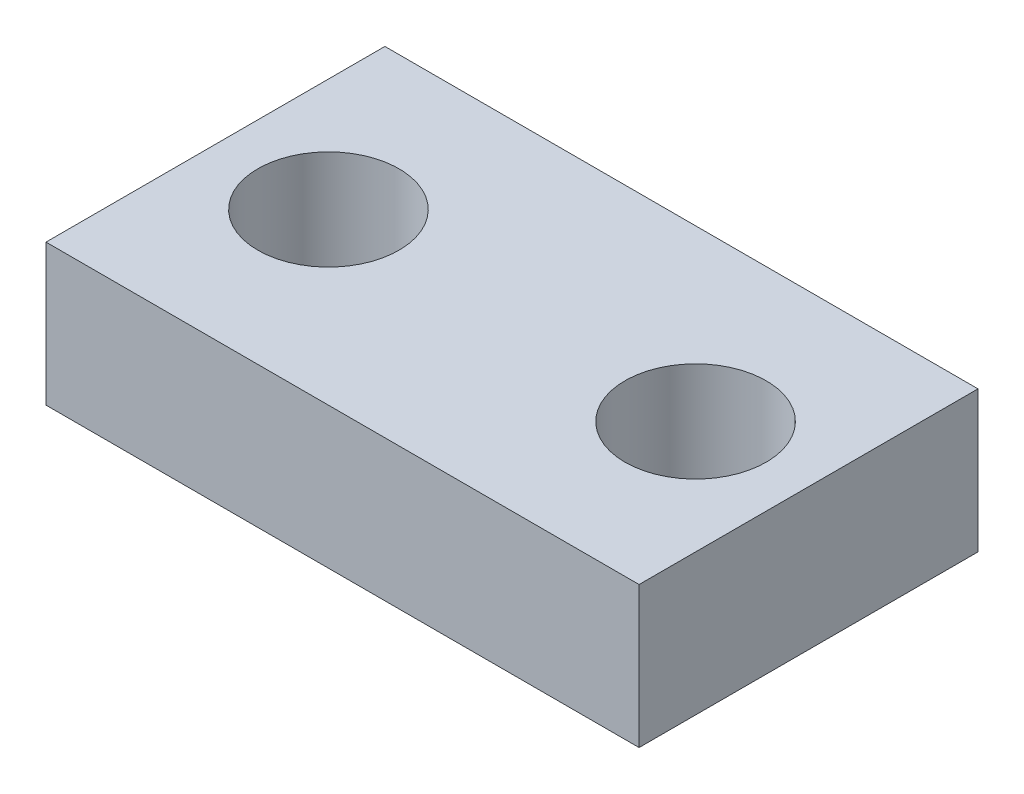
ISO-10303-21;
HEADER;
FILE_DESCRIPTION(('STEP AP214'),'2;1');
FILE_NAME('part.step','',(''),(''),'','','');
FILE_SCHEMA(('AUTOMOTIVE_DESIGN { 1 0 10303 214 1 1 1 1 }'));
ENDSEC;
DATA;
#1=APPLICATION_CONTEXT('core data for automotive mechanical design processes');
#2=APPLICATION_PROTOCOL_DEFINITION('international standard','automotive_design',2000,#1);
#3=PRODUCT_CONTEXT('',#1,'mechanical');
#4=PRODUCT('Part','Part','',(#3));
#5=PRODUCT_RELATED_PRODUCT_CATEGORY('part','',(#4));
#6=PRODUCT_DEFINITION_FORMATION('','',#4);
#7=PRODUCT_DEFINITION_CONTEXT('part definition',#1,'design');
#8=PRODUCT_DEFINITION('design','',#6,#7);
#9=PRODUCT_DEFINITION_SHAPE('','',#8);
#10=(LENGTH_UNIT() NAMED_UNIT(*) SI_UNIT(.MILLI.,.METRE.));
#11=(NAMED_UNIT(*) PLANE_ANGLE_UNIT() SI_UNIT($,.RADIAN.));
#12=(NAMED_UNIT(*) SI_UNIT($,.STERADIAN.) SOLID_ANGLE_UNIT());
#13=UNCERTAINTY_MEASURE_WITH_UNIT(LENGTH_MEASURE(1.E-05),#10,'distance_accuracy_value','');
#14=(GEOMETRIC_REPRESENTATION_CONTEXT(3) GLOBAL_UNCERTAINTY_ASSIGNED_CONTEXT((#13)) GLOBAL_UNIT_ASSIGNED_CONTEXT((#10,
#11,#12)) REPRESENTATION_CONTEXT('',''));
#15=CARTESIAN_POINT('',(0.,0.,0.));
#16=DIRECTION('',(0.,0.,1.));
#17=DIRECTION('',(1.,0.,0.));
#18=AXIS2_PLACEMENT_3D('',#15,#16,#17);
#19=CARTESIAN_POINT('',(33.3375,15.875,19.05));
#20=DIRECTION('',(-1.,0.,0.));
#21=DIRECTION('',(0.,0.,1.));
#22=AXIS2_PLACEMENT_3D('',#19,#20,#21);
#23=PLANE('',#22);
#24=DIRECTION('',(0.,0.,-1.));
#25=VECTOR('',#24,1.);
#26=CARTESIAN_POINT('',(33.3375,0.,19.05));
#27=LINE('',#26,#25);
#28=CARTESIAN_POINT('',(33.3375,0.,19.05));
#29=VERTEX_POINT('',#28);
#30=CARTESIAN_POINT('',(33.3375,0.,-19.05));
#31=VERTEX_POINT('',#30);
#32=EDGE_CURVE('E112',#29,#31,#27,.T.);
#33=ORIENTED_EDGE('',*,*,#32,.T.);
#34=DIRECTION('',(0.,-1.,0.));
#35=VECTOR('',#34,1.);
#36=CARTESIAN_POINT('',(33.3375,15.875,-19.05));
#37=LINE('',#36,#35);
#38=CARTESIAN_POINT('',(33.3375,15.875,-19.05));
#39=VERTEX_POINT('',#38);
#40=EDGE_CURVE('E11',#39,#31,#37,.T.);
#41=ORIENTED_EDGE('',*,*,#40,.F.);
#42=DIRECTION('',(0.,0.,-1.));
#43=VECTOR('',#42,1.);
#44=CARTESIAN_POINT('',(33.3375,15.875,19.05));
#45=LINE('',#44,#43);
#46=CARTESIAN_POINT('',(33.3375,15.875,19.05));
#47=VERTEX_POINT('',#46);
#48=EDGE_CURVE('E95',#47,#39,#45,.T.);
#49=ORIENTED_EDGE('',*,*,#48,.F.);
#50=DIRECTION('',(0.,-1.,0.));
#51=VECTOR('',#50,1.);
#52=CARTESIAN_POINT('',(33.3375,15.875,19.05));
#53=LINE('',#52,#51);
#54=EDGE_CURVE('E108',#47,#29,#53,.T.);
#55=ORIENTED_EDGE('',*,*,#54,.T.);
#56=EDGE_LOOP('',(#33,#41,#49,#55));
#57=FACE_BOUND('',#56,.T.);
#58=ADVANCED_FACE('F43',(#57),#23,.F.);
#59=CARTESIAN_POINT('',(-33.3375,15.875,-19.05));
#60=DIRECTION('',(0.,0.,1.));
#61=DIRECTION('',(1.,0.,0.));
#62=AXIS2_PLACEMENT_3D('',#59,#60,#61);
#63=PLANE('',#62);
#64=DIRECTION('',(-1.,0.,0.));
#65=VECTOR('',#64,1.);
#66=CARTESIAN_POINT('',(-33.3375,0.,-19.05));
#67=LINE('',#66,#65);
#68=CARTESIAN_POINT('',(-33.3375,0.,-19.05));
#69=VERTEX_POINT('',#68);
#70=EDGE_CURVE('E100',#31,#69,#67,.T.);
#71=ORIENTED_EDGE('',*,*,#70,.T.);
#72=DIRECTION('',(0.,-1.,0.));
#73=VECTOR('',#72,1.);
#74=CARTESIAN_POINT('',(-33.3375,15.875,-19.05));
#75=LINE('',#74,#73);
#76=CARTESIAN_POINT('',(-33.3375,15.875,-19.05));
#77=VERTEX_POINT('',#76);
#78=EDGE_CURVE('E52',#77,#69,#75,.T.);
#79=ORIENTED_EDGE('',*,*,#78,.F.);
#80=DIRECTION('',(-1.,0.,0.));
#81=VECTOR('',#80,1.);
#82=CARTESIAN_POINT('',(-33.3375,15.875,-19.05));
#83=LINE('',#82,#81);
#84=EDGE_CURVE('E90',#39,#77,#83,.T.);
#85=ORIENTED_EDGE('',*,*,#84,.F.);
#86=ORIENTED_EDGE('',*,*,#40,.T.);
#87=EDGE_LOOP('',(#71,#79,#85,#86));
#88=FACE_BOUND('',#87,.T.);
#89=ADVANCED_FACE('F99',(#88),#63,.F.);
#90=CARTESIAN_POINT('',(-33.3375,15.875,19.05));
#91=DIRECTION('',(1.,0.,0.));
#92=DIRECTION('',(0.,0.,-1.));
#93=AXIS2_PLACEMENT_3D('',#90,#91,#92);
#94=PLANE('',#93);
#95=DIRECTION('',(0.,0.,1.));
#96=VECTOR('',#95,1.);
#97=CARTESIAN_POINT('',(-33.3375,0.,19.05));
#98=LINE('',#97,#96);
#99=CARTESIAN_POINT('',(-33.3375,0.,19.05));
#100=VERTEX_POINT('',#99);
#101=EDGE_CURVE('E77',#69,#100,#98,.T.);
#102=ORIENTED_EDGE('',*,*,#101,.T.);
#103=DIRECTION('',(0.,-1.,0.));
#104=VECTOR('',#103,1.);
#105=CARTESIAN_POINT('',(-33.3375,15.875,19.05));
#106=LINE('',#105,#104);
#107=CARTESIAN_POINT('',(-33.3375,15.875,19.05));
#108=VERTEX_POINT('',#107);
#109=EDGE_CURVE('E102',#108,#100,#106,.T.);
#110=ORIENTED_EDGE('',*,*,#109,.F.);
#111=DIRECTION('',(0.,0.,1.));
#112=VECTOR('',#111,1.);
#113=CARTESIAN_POINT('',(-33.3375,15.875,19.05));
#114=LINE('',#113,#112);
#115=EDGE_CURVE('E93',#77,#108,#114,.T.);
#116=ORIENTED_EDGE('',*,*,#115,.F.);
#117=ORIENTED_EDGE('',*,*,#78,.T.);
#118=EDGE_LOOP('',(#102,#110,#116,#117));
#119=FACE_BOUND('',#118,.T.);
#120=ADVANCED_FACE('F103',(#119),#94,.F.);
#121=CARTESIAN_POINT('',(-33.3375,15.875,19.05));
#122=DIRECTION('',(0.,0.,-1.));
#123=DIRECTION('',(-1.,0.,0.));
#124=AXIS2_PLACEMENT_3D('',#121,#122,#123);
#125=PLANE('',#124);
#126=DIRECTION('',(1.,0.,0.));
#127=VECTOR('',#126,1.);
#128=CARTESIAN_POINT('',(-33.3375,0.,19.05));
#129=LINE('',#128,#127);
#130=EDGE_CURVE('E83',#100,#29,#129,.T.);
#131=ORIENTED_EDGE('',*,*,#130,.T.);
#132=ORIENTED_EDGE('',*,*,#54,.F.);
#133=DIRECTION('',(1.,0.,0.));
#134=VECTOR('',#133,1.);
#135=CARTESIAN_POINT('',(-33.3375,15.875,19.05));
#136=LINE('',#135,#134);
#137=EDGE_CURVE('E60',#108,#47,#136,.T.);
#138=ORIENTED_EDGE('',*,*,#137,.F.);
#139=ORIENTED_EDGE('',*,*,#109,.T.);
#140=EDGE_LOOP('',(#131,#132,#138,#139));
#141=FACE_BOUND('',#140,.T.);
#142=ADVANCED_FACE('F127',(#141),#125,.F.);
#143=CARTESIAN_POINT('',(0.,15.875,0.));
#144=DIRECTION('',(0.,-1.,0.));
#145=DIRECTION('',(0.,0.,-1.));
#146=AXIS2_PLACEMENT_3D('',#143,#144,#145);
#147=PLANE('',#146);
#148=CARTESIAN_POINT('',(-20.6375,15.875,0.));
#149=DIRECTION('',(0.,1.,0.));
#150=DIRECTION('',(0.,0.,1.));
#151=AXIS2_PLACEMENT_3D('',#148,#149,#150);
#152=CIRCLE('',#151,7.9375);
#153=CARTESIAN_POINT('',(-20.6375,15.875,7.9375));
#154=VERTEX_POINT('',#153);
#155=EDGE_CURVE('E143',#154,#154,#152,.T.);
#156=ORIENTED_EDGE('',*,*,#155,.F.);
#157=EDGE_LOOP('',(#156));
#158=FACE_BOUND('',#157,.T.);
#159=CARTESIAN_POINT('',(20.6375,15.875,0.));
#160=DIRECTION('',(0.,1.,0.));
#161=DIRECTION('',(0.,0.,1.));
#162=AXIS2_PLACEMENT_3D('',#159,#160,#161);
#163=CIRCLE('',#162,7.93750000000001);
#164=CARTESIAN_POINT('',(20.6375,15.875,7.93750000000001));
#165=VERTEX_POINT('',#164);
#166=EDGE_CURVE('E135',#165,#165,#163,.T.);
#167=ORIENTED_EDGE('',*,*,#166,.F.);
#168=EDGE_LOOP('',(#167));
#169=FACE_BOUND('',#168,.T.);
#170=ORIENTED_EDGE('',*,*,#48,.T.);
#171=ORIENTED_EDGE('',*,*,#84,.T.);
#172=ORIENTED_EDGE('',*,*,#115,.T.);
#173=ORIENTED_EDGE('',*,*,#137,.T.);
#174=EDGE_LOOP('',(#170,#171,#172,#173));
#175=FACE_BOUND('',#174,.T.);
#176=ADVANCED_FACE('F91',(#158,#169,#175),#147,.F.);
#177=CARTESIAN_POINT('',(0.,0.,0.));
#178=DIRECTION('',(0.,-1.,0.));
#179=DIRECTION('',(0.,0.,-1.));
#180=AXIS2_PLACEMENT_3D('',#177,#178,#179);
#181=PLANE('',#180);
#182=CARTESIAN_POINT('',(-20.6375,0.,0.));
#183=DIRECTION('',(0.,1.,0.));
#184=DIRECTION('',(0.,0.,1.));
#185=AXIS2_PLACEMENT_3D('',#182,#183,#184);
#186=CIRCLE('',#185,7.9375);
#187=CARTESIAN_POINT('',(-20.6375,0.,7.9375));
#188=VERTEX_POINT('',#187);
#189=EDGE_CURVE('E116',#188,#188,#186,.T.);
#190=ORIENTED_EDGE('',*,*,#189,.T.);
#191=EDGE_LOOP('',(#190));
#192=FACE_BOUND('',#191,.T.);
#193=CARTESIAN_POINT('',(20.6375,0.,0.));
#194=DIRECTION('',(0.,1.,0.));
#195=DIRECTION('',(0.,0.,1.));
#196=AXIS2_PLACEMENT_3D('',#193,#194,#195);
#197=CIRCLE('',#196,7.93750000000001);
#198=CARTESIAN_POINT('',(20.6375,0.,7.93750000000001));
#199=VERTEX_POINT('',#198);
#200=EDGE_CURVE('E139',#199,#199,#197,.T.);
#201=ORIENTED_EDGE('',*,*,#200,.T.);
#202=EDGE_LOOP('',(#201));
#203=FACE_BOUND('',#202,.T.);
#204=ORIENTED_EDGE('',*,*,#32,.F.);
#205=ORIENTED_EDGE('',*,*,#130,.F.);
#206=ORIENTED_EDGE('',*,*,#101,.F.);
#207=ORIENTED_EDGE('',*,*,#70,.F.);
#208=EDGE_LOOP('',(#204,#205,#206,#207));
#209=FACE_BOUND('',#208,.T.);
#210=ADVANCED_FACE('F130',(#192,#203,#209),#181,.T.);
#211=CARTESIAN_POINT('',(20.6375,0.,0.));
#212=DIRECTION('',(0.,1.,0.));
#213=DIRECTION('',(0.,0.,1.));
#214=AXIS2_PLACEMENT_3D('',#211,#212,#213);
#215=CYLINDRICAL_SURFACE('',#214,7.93750000000001);
#216=ORIENTED_EDGE('',*,*,#200,.F.);
#217=EDGE_LOOP('',(#216));
#218=FACE_BOUND('',#217,.T.);
#219=ORIENTED_EDGE('',*,*,#166,.T.);
#220=EDGE_LOOP('',(#219));
#221=FACE_BOUND('',#220,.T.);
#222=ADVANCED_FACE('F157',(#218,#221),#215,.F.);
#223=CARTESIAN_POINT('',(-20.6375,0.,0.));
#224=DIRECTION('',(0.,1.,0.));
#225=DIRECTION('',(0.,0.,1.));
#226=AXIS2_PLACEMENT_3D('',#223,#224,#225);
#227=CYLINDRICAL_SURFACE('',#226,7.9375);
#228=ORIENTED_EDGE('',*,*,#189,.F.);
#229=EDGE_LOOP('',(#228));
#230=FACE_BOUND('',#229,.T.);
#231=ORIENTED_EDGE('',*,*,#155,.T.);
#232=EDGE_LOOP('',(#231));
#233=FACE_BOUND('',#232,.T.);
#234=ADVANCED_FACE('F154',(#230,#233),#227,.F.);
#235=CLOSED_SHELL('',(#58,#89,#120,#142,#176,#210,#222,#234));
#236=MANIFOLD_SOLID_BREP('B2',#235);
#237=ADVANCED_BREP_SHAPE_REPRESENTATION('',(#18,#236),#14);
#238=SHAPE_DEFINITION_REPRESENTATION(#9,#237);
ENDSEC;
END-ISO-10303-21;
